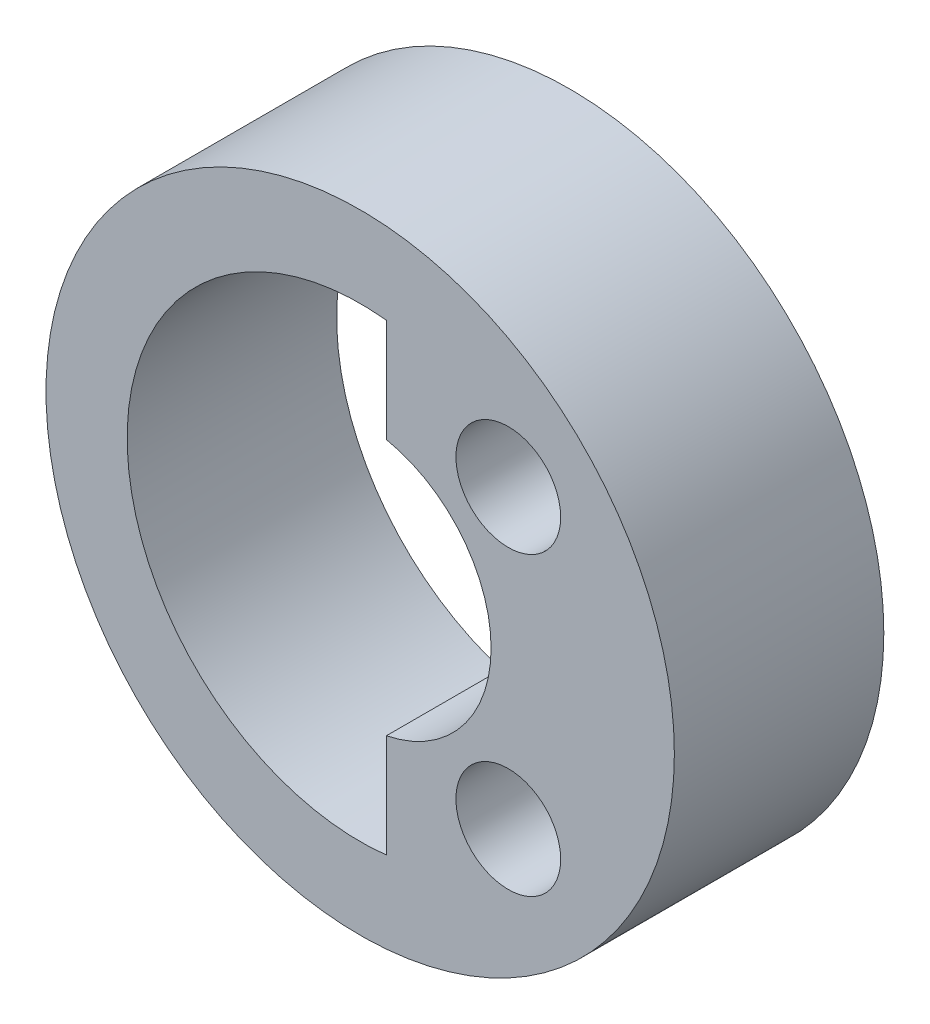
ISO-10303-21;
HEADER;
FILE_DESCRIPTION(('STEP AP214'),'2;1');
FILE_NAME('part.step','',(''),(''),'','','');
FILE_SCHEMA(('AUTOMOTIVE_DESIGN { 1 0 10303 214 1 1 1 1 }'));
ENDSEC;
DATA;
#1=APPLICATION_CONTEXT('core data for automotive mechanical design processes');
#2=APPLICATION_PROTOCOL_DEFINITION('international standard','automotive_design',2000,#1);
#3=PRODUCT_CONTEXT('',#1,'mechanical');
#4=PRODUCT('Part','Part','',(#3));
#5=PRODUCT_RELATED_PRODUCT_CATEGORY('part','',(#4));
#6=PRODUCT_DEFINITION_FORMATION('','',#4);
#7=PRODUCT_DEFINITION_CONTEXT('part definition',#1,'design');
#8=PRODUCT_DEFINITION('design','',#6,#7);
#9=PRODUCT_DEFINITION_SHAPE('','',#8);
#10=(LENGTH_UNIT() NAMED_UNIT(*) SI_UNIT(.MILLI.,.METRE.));
#11=(NAMED_UNIT(*) PLANE_ANGLE_UNIT() SI_UNIT($,.RADIAN.));
#12=(NAMED_UNIT(*) SI_UNIT($,.STERADIAN.) SOLID_ANGLE_UNIT());
#13=UNCERTAINTY_MEASURE_WITH_UNIT(LENGTH_MEASURE(1.E-05),#10,'distance_accuracy_value','');
#14=(GEOMETRIC_REPRESENTATION_CONTEXT(3) GLOBAL_UNCERTAINTY_ASSIGNED_CONTEXT((#13)) GLOBAL_UNIT_ASSIGNED_CONTEXT((#10,
#11,#12)) REPRESENTATION_CONTEXT('',''));
#15=CARTESIAN_POINT('',(0.,0.,0.));
#16=DIRECTION('',(0.,0.,1.));
#17=DIRECTION('',(1.,0.,0.));
#18=AXIS2_PLACEMENT_3D('',#15,#16,#17);
#19=CARTESIAN_POINT('',(0.,0.,-0.0999999999999994));
#20=DIRECTION('',(0.,0.,-1.));
#21=DIRECTION('',(-1.,0.,0.));
#22=AXIS2_PLACEMENT_3D('',#19,#20,#21);
#23=CYLINDRICAL_SURFACE('',#22,3.);
#24=CARTESIAN_POINT('',(0.,0.,-0.0999999999999994));
#25=DIRECTION('',(0.,0.,1.));
#26=DIRECTION('',(1.,0.,0.));
#27=AXIS2_PLACEMENT_3D('',#24,#25,#26);
#28=CIRCLE('',#27,3.);
#29=CARTESIAN_POINT('',(3.,0.,-0.0999999999999994));
#30=VERTEX_POINT('',#29);
#31=EDGE_CURVE('E11',#30,#30,#28,.T.);
#32=ORIENTED_EDGE('',*,*,#31,.F.);
#33=EDGE_LOOP('',(#32));
#34=FACE_BOUND('',#33,.T.);
#35=CARTESIAN_POINT('',(0.,0.,-2.1));
#36=DIRECTION('',(0.,0.,1.));
#37=DIRECTION('',(1.,0.,0.));
#38=AXIS2_PLACEMENT_3D('',#35,#36,#37);
#39=CIRCLE('',#38,3.);
#40=CARTESIAN_POINT('',(3.,0.,-2.1));
#41=VERTEX_POINT('',#40);
#42=EDGE_CURVE('E35',#41,#41,#39,.T.);
#43=ORIENTED_EDGE('',*,*,#42,.T.);
#44=EDGE_LOOP('',(#43));
#45=FACE_BOUND('',#44,.T.);
#46=ADVANCED_FACE('F32',(#34,#45),#23,.T.);
#47=CARTESIAN_POINT('',(0.,0.,-0.0999999999999994));
#48=DIRECTION('',(0.,0.,1.));
#49=DIRECTION('',(1.,0.,0.));
#50=AXIS2_PLACEMENT_3D('',#47,#48,#49);
#51=PLANE('',#50);
#52=CARTESIAN_POINT('',(1.4142135623731,-1.41421356237309,-0.0999999999999994));
#53=DIRECTION('',(0.,0.,-1.));
#54=DIRECTION('',(1.,0.,0.));
#55=AXIS2_PLACEMENT_3D('',#52,#53,#54);
#56=CIRCLE('',#55,0.5);
#57=CARTESIAN_POINT('',(1.9142135623731,-1.41421356237309,-0.0999999999999994));
#58=VERTEX_POINT('',#57);
#59=EDGE_CURVE('E168',#58,#58,#56,.T.);
#60=ORIENTED_EDGE('',*,*,#59,.T.);
#61=EDGE_LOOP('',(#60));
#62=FACE_BOUND('',#61,.T.);
#63=CARTESIAN_POINT('',(1.4142135623731,1.41421356237309,-0.0999999999999994));
#64=DIRECTION('',(0.,0.,1.));
#65=DIRECTION('',(1.,0.,0.));
#66=AXIS2_PLACEMENT_3D('',#63,#64,#65);
#67=CIRCLE('',#66,0.5);
#68=CARTESIAN_POINT('',(1.9142135623731,1.41421356237309,-0.0999999999999994));
#69=VERTEX_POINT('',#68);
#70=EDGE_CURVE('E96',#69,#69,#67,.T.);
#71=ORIENTED_EDGE('',*,*,#70,.F.);
#72=EDGE_LOOP('',(#71));
#73=FACE_BOUND('',#72,.T.);
#74=DIRECTION('',(0.,1.,0.));
#75=VECTOR('',#74,1.);
#76=CARTESIAN_POINT('',(0.25,-2.21091044594755,-0.0999999999999994));
#77=LINE('',#76,#75);
#78=CARTESIAN_POINT('',(0.25,-2.21091044594755,-0.0999999999999994));
#79=VERTEX_POINT('',#78);
#80=CARTESIAN_POINT('',(0.25,-1.22474487139159,-0.0999999999999994));
#81=VERTEX_POINT('',#80);
#82=EDGE_CURVE('E46',#79,#81,#77,.T.);
#83=ORIENTED_EDGE('',*,*,#82,.F.);
#84=CARTESIAN_POINT('',(0.,0.,-0.0999999999999994));
#85=DIRECTION('',(0.,0.,1.));
#86=DIRECTION('',(1.,0.,0.));
#87=AXIS2_PLACEMENT_3D('',#84,#85,#86);
#88=CIRCLE('',#87,2.225);
#89=CARTESIAN_POINT('',(0.25,2.21091044594755,-0.0999999999999994));
#90=VERTEX_POINT('',#89);
#91=EDGE_CURVE('E90',#90,#79,#88,.T.);
#92=ORIENTED_EDGE('',*,*,#91,.F.);
#93=DIRECTION('',(0.,1.,0.));
#94=VECTOR('',#93,1.);
#95=CARTESIAN_POINT('',(0.25,1.22474487139159,-0.0999999999999994));
#96=LINE('',#95,#94);
#97=CARTESIAN_POINT('',(0.25,1.22474487139159,-0.0999999999999994));
#98=VERTEX_POINT('',#97);
#99=EDGE_CURVE('E93',#98,#90,#96,.T.);
#100=ORIENTED_EDGE('',*,*,#99,.F.);
#101=CARTESIAN_POINT('',(0.,0.,-0.0999999999999994));
#102=DIRECTION('',(0.,0.,1.));
#103=DIRECTION('',(1.,0.,0.));
#104=AXIS2_PLACEMENT_3D('',#101,#102,#103);
#105=CIRCLE('',#104,1.25);
#106=EDGE_CURVE('E102',#81,#98,#105,.T.);
#107=ORIENTED_EDGE('',*,*,#106,.F.);
#108=EDGE_LOOP('',(#83,#92,#100,#107));
#109=FACE_BOUND('',#108,.T.);
#110=ORIENTED_EDGE('',*,*,#31,.T.);
#111=EDGE_LOOP('',(#110));
#112=FACE_BOUND('',#111,.T.);
#113=ADVANCED_FACE('F115',(#62,#73,#109,#112),#51,.T.);
#114=CARTESIAN_POINT('',(0.,0.,-2.1));
#115=DIRECTION('',(0.,0.,1.));
#116=DIRECTION('',(1.,0.,0.));
#117=AXIS2_PLACEMENT_3D('',#114,#115,#116);
#118=PLANE('',#117);
#119=CARTESIAN_POINT('',(1.4142135623731,-1.41421356237309,-2.1));
#120=DIRECTION('',(0.,0.,-1.));
#121=DIRECTION('',(1.,0.,0.));
#122=AXIS2_PLACEMENT_3D('',#119,#120,#121);
#123=CIRCLE('',#122,0.5);
#124=CARTESIAN_POINT('',(1.9142135623731,-1.41421356237309,-2.1));
#125=VERTEX_POINT('',#124);
#126=EDGE_CURVE('E166',#125,#125,#123,.T.);
#127=ORIENTED_EDGE('',*,*,#126,.F.);
#128=EDGE_LOOP('',(#127));
#129=FACE_BOUND('',#128,.T.);
#130=CARTESIAN_POINT('',(1.4142135623731,1.41421356237309,-2.1));
#131=DIRECTION('',(0.,0.,1.));
#132=DIRECTION('',(1.,0.,0.));
#133=AXIS2_PLACEMENT_3D('',#130,#131,#132);
#134=CIRCLE('',#133,0.5);
#135=CARTESIAN_POINT('',(1.9142135623731,1.41421356237309,-2.1));
#136=VERTEX_POINT('',#135);
#137=EDGE_CURVE('E103',#136,#136,#134,.T.);
#138=ORIENTED_EDGE('',*,*,#137,.T.);
#139=EDGE_LOOP('',(#138));
#140=FACE_BOUND('',#139,.T.);
#141=CARTESIAN_POINT('',(0.,0.,-2.1));
#142=DIRECTION('',(0.,0.,1.));
#143=DIRECTION('',(1.,0.,0.));
#144=AXIS2_PLACEMENT_3D('',#141,#142,#143);
#145=CIRCLE('',#144,2.225);
#146=CARTESIAN_POINT('',(0.25,2.21091044594755,-2.1));
#147=VERTEX_POINT('',#146);
#148=CARTESIAN_POINT('',(0.25,-2.21091044594755,-2.1));
#149=VERTEX_POINT('',#148);
#150=EDGE_CURVE('E80',#147,#149,#145,.T.);
#151=ORIENTED_EDGE('',*,*,#150,.T.);
#152=DIRECTION('',(0.,1.,0.));
#153=VECTOR('',#152,1.);
#154=CARTESIAN_POINT('',(0.25,-2.21091044594755,-2.1));
#155=LINE('',#154,#153);
#156=CARTESIAN_POINT('',(0.25,-1.22474487139159,-2.1));
#157=VERTEX_POINT('',#156);
#158=EDGE_CURVE('E74',#149,#157,#155,.T.);
#159=ORIENTED_EDGE('',*,*,#158,.T.);
#160=CARTESIAN_POINT('',(0.,0.,-2.1));
#161=DIRECTION('',(0.,0.,1.));
#162=DIRECTION('',(1.,0.,0.));
#163=AXIS2_PLACEMENT_3D('',#160,#161,#162);
#164=CIRCLE('',#163,1.25);
#165=CARTESIAN_POINT('',(0.25,1.22474487139159,-2.1));
#166=VERTEX_POINT('',#165);
#167=EDGE_CURVE('E83',#157,#166,#164,.T.);
#168=ORIENTED_EDGE('',*,*,#167,.T.);
#169=DIRECTION('',(0.,1.,0.));
#170=VECTOR('',#169,1.);
#171=CARTESIAN_POINT('',(0.25,1.22474487139159,-2.1));
#172=LINE('',#171,#170);
#173=EDGE_CURVE('E54',#166,#147,#172,.T.);
#174=ORIENTED_EDGE('',*,*,#173,.T.);
#175=EDGE_LOOP('',(#151,#159,#168,#174));
#176=FACE_BOUND('',#175,.T.);
#177=ORIENTED_EDGE('',*,*,#42,.F.);
#178=EDGE_LOOP('',(#177));
#179=FACE_BOUND('',#178,.T.);
#180=ADVANCED_FACE('F87',(#129,#140,#176,#179),#118,.F.);
#181=CARTESIAN_POINT('',(0.25,-2.21091044594755,-2.1));
#182=DIRECTION('',(1.,0.,0.));
#183=DIRECTION('',(0.,0.,-1.));
#184=AXIS2_PLACEMENT_3D('',#181,#182,#183);
#185=PLANE('',#184);
#186=ORIENTED_EDGE('',*,*,#82,.T.);
#187=DIRECTION('',(0.,0.,1.));
#188=VECTOR('',#187,1.);
#189=CARTESIAN_POINT('',(0.25,-1.22474487139159,-2.1));
#190=LINE('',#189,#188);
#191=EDGE_CURVE('E70',#157,#81,#190,.T.);
#192=ORIENTED_EDGE('',*,*,#191,.F.);
#193=ORIENTED_EDGE('',*,*,#158,.F.);
#194=DIRECTION('',(0.,0.,1.));
#195=VECTOR('',#194,1.);
#196=CARTESIAN_POINT('',(0.25,-2.21091044594755,-2.1));
#197=LINE('',#196,#195);
#198=EDGE_CURVE('E107',#149,#79,#197,.T.);
#199=ORIENTED_EDGE('',*,*,#198,.T.);
#200=EDGE_LOOP('',(#186,#192,#193,#199));
#201=FACE_BOUND('',#200,.T.);
#202=ADVANCED_FACE('F72',(#201),#185,.F.);
#203=CARTESIAN_POINT('',(0.,0.,-2.1));
#204=DIRECTION('',(0.,0.,1.));
#205=DIRECTION('',(1.,0.,0.));
#206=AXIS2_PLACEMENT_3D('',#203,#204,#205);
#207=CYLINDRICAL_SURFACE('',#206,2.225);
#208=ORIENTED_EDGE('',*,*,#91,.T.);
#209=ORIENTED_EDGE('',*,*,#198,.F.);
#210=ORIENTED_EDGE('',*,*,#150,.F.);
#211=DIRECTION('',(0.,0.,1.));
#212=VECTOR('',#211,1.);
#213=CARTESIAN_POINT('',(0.25,2.21091044594755,-2.1));
#214=LINE('',#213,#212);
#215=EDGE_CURVE('E109',#147,#90,#214,.T.);
#216=ORIENTED_EDGE('',*,*,#215,.T.);
#217=EDGE_LOOP('',(#208,#209,#210,#216));
#218=FACE_BOUND('',#217,.T.);
#219=ADVANCED_FACE('F118',(#218),#207,.F.);
#220=CARTESIAN_POINT('',(0.25,1.22474487139159,-2.1));
#221=DIRECTION('',(1.,0.,0.));
#222=DIRECTION('',(0.,0.,-1.));
#223=AXIS2_PLACEMENT_3D('',#220,#221,#222);
#224=PLANE('',#223);
#225=ORIENTED_EDGE('',*,*,#99,.T.);
#226=ORIENTED_EDGE('',*,*,#215,.F.);
#227=ORIENTED_EDGE('',*,*,#173,.F.);
#228=DIRECTION('',(0.,0.,1.));
#229=VECTOR('',#228,1.);
#230=CARTESIAN_POINT('',(0.25,1.22474487139159,-2.1));
#231=LINE('',#230,#229);
#232=EDGE_CURVE('E79',#166,#98,#231,.T.);
#233=ORIENTED_EDGE('',*,*,#232,.T.);
#234=EDGE_LOOP('',(#225,#226,#227,#233));
#235=FACE_BOUND('',#234,.T.);
#236=ADVANCED_FACE('F111',(#235),#224,.F.);
#237=CARTESIAN_POINT('',(0.,0.,-2.1));
#238=DIRECTION('',(0.,0.,1.));
#239=DIRECTION('',(1.,0.,0.));
#240=AXIS2_PLACEMENT_3D('',#237,#238,#239);
#241=CYLINDRICAL_SURFACE('',#240,1.25);
#242=ORIENTED_EDGE('',*,*,#106,.T.);
#243=ORIENTED_EDGE('',*,*,#232,.F.);
#244=ORIENTED_EDGE('',*,*,#167,.F.);
#245=ORIENTED_EDGE('',*,*,#191,.T.);
#246=EDGE_LOOP('',(#242,#243,#244,#245));
#247=FACE_BOUND('',#246,.T.);
#248=ADVANCED_FACE('F84',(#247),#241,.F.);
#249=CARTESIAN_POINT('',(1.4142135623731,1.41421356237309,-2.1));
#250=DIRECTION('',(0.,0.,1.));
#251=DIRECTION('',(1.,0.,0.));
#252=AXIS2_PLACEMENT_3D('',#249,#250,#251);
#253=CYLINDRICAL_SURFACE('',#252,0.5);
#254=ORIENTED_EDGE('',*,*,#137,.F.);
#255=EDGE_LOOP('',(#254));
#256=FACE_BOUND('',#255,.T.);
#257=ORIENTED_EDGE('',*,*,#70,.T.);
#258=EDGE_LOOP('',(#257));
#259=FACE_BOUND('',#258,.T.);
#260=ADVANCED_FACE('F149',(#256,#259),#253,.F.);
#261=CARTESIAN_POINT('',(1.4142135623731,-1.41421356237309,-2.1));
#262=DIRECTION('',(0.,0.,1.));
#263=DIRECTION('',(1.,0.,0.));
#264=AXIS2_PLACEMENT_3D('',#261,#262,#263);
#265=CYLINDRICAL_SURFACE('',#264,0.5);
#266=ORIENTED_EDGE('',*,*,#126,.T.);
#267=EDGE_LOOP('',(#266));
#268=FACE_BOUND('',#267,.T.);
#269=ORIENTED_EDGE('',*,*,#59,.F.);
#270=EDGE_LOOP('',(#269));
#271=FACE_BOUND('',#270,.T.);
#272=ADVANCED_FACE('F153',(#268,#271),#265,.F.);
#273=CLOSED_SHELL('',(#46,#113,#180,#202,#219,#236,#248,#260,#272));
#274=MANIFOLD_SOLID_BREP('B2',#273);
#275=ADVANCED_BREP_SHAPE_REPRESENTATION('',(#18,#274),#14);
#276=SHAPE_DEFINITION_REPRESENTATION(#9,#275);
ENDSEC;
END-ISO-10303-21;
